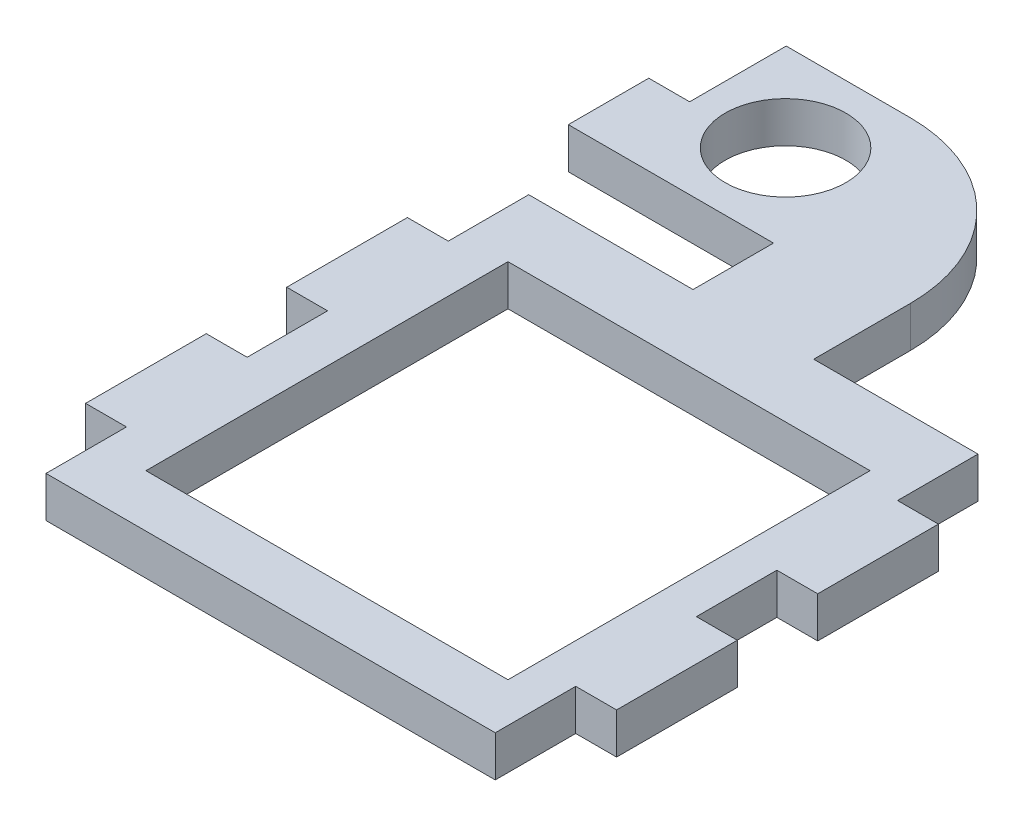
ISO-10303-21;
HEADER;
FILE_DESCRIPTION(('STEP AP214'),'2;1');
FILE_NAME('part.step','',(''),(''),'','','');
FILE_SCHEMA(('AUTOMOTIVE_DESIGN { 1 0 10303 214 1 1 1 1 }'));
ENDSEC;
DATA;
#1=APPLICATION_CONTEXT('core data for automotive mechanical design processes');
#2=APPLICATION_PROTOCOL_DEFINITION('international standard','automotive_design',2000,#1);
#3=PRODUCT_CONTEXT('',#1,'mechanical');
#4=PRODUCT('Part','Part','',(#3));
#5=PRODUCT_RELATED_PRODUCT_CATEGORY('part','',(#4));
#6=PRODUCT_DEFINITION_FORMATION('','',#4);
#7=PRODUCT_DEFINITION_CONTEXT('part definition',#1,'design');
#8=PRODUCT_DEFINITION('design','',#6,#7);
#9=PRODUCT_DEFINITION_SHAPE('','',#8);
#10=(LENGTH_UNIT() NAMED_UNIT(*) SI_UNIT(.MILLI.,.METRE.));
#11=(NAMED_UNIT(*) PLANE_ANGLE_UNIT() SI_UNIT($,.RADIAN.));
#12=(NAMED_UNIT(*) SI_UNIT($,.STERADIAN.) SOLID_ANGLE_UNIT());
#13=UNCERTAINTY_MEASURE_WITH_UNIT(LENGTH_MEASURE(1.E-05),#10,'distance_accuracy_value','');
#14=(GEOMETRIC_REPRESENTATION_CONTEXT(3) GLOBAL_UNCERTAINTY_ASSIGNED_CONTEXT((#13)) GLOBAL_UNIT_ASSIGNED_CONTEXT((#10,
#11,#12)) REPRESENTATION_CONTEXT('',''));
#15=CARTESIAN_POINT('',(0.,0.,0.));
#16=DIRECTION('',(0.,0.,1.));
#17=DIRECTION('',(1.,0.,0.));
#18=AXIS2_PLACEMENT_3D('',#15,#16,#17);
#19=CARTESIAN_POINT('',(27.92,5.08,-30.));
#20=DIRECTION('',(0.,0.,1.));
#21=DIRECTION('',(1.,0.,0.));
#22=AXIS2_PLACEMENT_3D('',#19,#20,#21);
#23=PLANE('',#22);
#24=DIRECTION('',(0.,1.,0.));
#25=VECTOR('',#24,1.);
#26=CARTESIAN_POINT('',(-7.5,-51.6163733712472,-30.));
#27=LINE('',#26,#25);
#28=CARTESIAN_POINT('',(-7.5,0.,-30.));
#29=VERTEX_POINT('',#28);
#30=CARTESIAN_POINT('',(-7.5,5.08,-30.));
#31=VERTEX_POINT('',#30);
#32=EDGE_CURVE('E286',#29,#31,#27,.T.);
#33=ORIENTED_EDGE('',*,*,#32,.F.);
#34=DIRECTION('',(-1.,0.,0.));
#35=VECTOR('',#34,1.);
#36=CARTESIAN_POINT('',(27.92,0.,-30.));
#37=LINE('',#36,#35);
#38=CARTESIAN_POINT('',(-27.92,0.,-30.));
#39=VERTEX_POINT('',#38);
#40=EDGE_CURVE('E385',#29,#39,#37,.T.);
#41=ORIENTED_EDGE('',*,*,#40,.T.);
#42=DIRECTION('',(0.,-1.,0.));
#43=VECTOR('',#42,1.);
#44=CARTESIAN_POINT('',(-27.92,5.08,-30.));
#45=LINE('',#44,#43);
#46=CARTESIAN_POINT('',(-27.92,5.08,-30.));
#47=VERTEX_POINT('',#46);
#48=EDGE_CURVE('E402',#47,#39,#45,.T.);
#49=ORIENTED_EDGE('',*,*,#48,.F.);
#50=DIRECTION('',(-1.,0.,0.));
#51=VECTOR('',#50,1.);
#52=CARTESIAN_POINT('',(27.92,5.08,-30.));
#53=LINE('',#52,#51);
#54=EDGE_CURVE('E457',#31,#47,#53,.T.);
#55=ORIENTED_EDGE('',*,*,#54,.F.);
#56=EDGE_LOOP('',(#33,#41,#49,#55));
#57=FACE_BOUND('',#56,.T.);
#58=ADVANCED_FACE('F33',(#57),#23,.F.);
#59=CARTESIAN_POINT('',(27.92,5.08,30.));
#60=DIRECTION('',(-1.,0.,0.));
#61=DIRECTION('',(0.,0.,1.));
#62=AXIS2_PLACEMENT_3D('',#59,#60,#61);
#63=PLANE('',#62);
#64=DIRECTION('',(0.,0.,-1.));
#65=VECTOR('',#64,1.);
#66=CARTESIAN_POINT('',(27.92,5.08,30.));
#67=LINE('',#66,#65);
#68=CARTESIAN_POINT('',(27.92,5.08,-20.));
#69=VERTEX_POINT('',#68);
#70=CARTESIAN_POINT('',(27.92,5.08,-30.));
#71=VERTEX_POINT('',#70);
#72=EDGE_CURVE('E393',#69,#71,#67,.T.);
#73=ORIENTED_EDGE('',*,*,#72,.F.);
#74=DIRECTION('',(0.,1.,0.));
#75=VECTOR('',#74,1.);
#76=CARTESIAN_POINT('',(27.92,-15.8368683773024,-20.));
#77=LINE('',#76,#75);
#78=CARTESIAN_POINT('',(27.92,0.,-20.));
#79=VERTEX_POINT('',#78);
#80=EDGE_CURVE('E686',#79,#69,#77,.T.);
#81=ORIENTED_EDGE('',*,*,#80,.F.);
#82=DIRECTION('',(0.,0.,-1.));
#83=VECTOR('',#82,1.);
#84=CARTESIAN_POINT('',(27.92,0.,30.));
#85=LINE('',#84,#83);
#86=CARTESIAN_POINT('',(27.92,0.,-30.));
#87=VERTEX_POINT('',#86);
#88=EDGE_CURVE('E432',#79,#87,#85,.T.);
#89=ORIENTED_EDGE('',*,*,#88,.T.);
#90=DIRECTION('',(0.,-1.,0.));
#91=VECTOR('',#90,1.);
#92=CARTESIAN_POINT('',(27.92,5.08,-30.));
#93=LINE('',#92,#91);
#94=EDGE_CURVE('E383',#71,#87,#93,.T.);
#95=ORIENTED_EDGE('',*,*,#94,.F.);
#96=EDGE_LOOP('',(#73,#81,#89,#95));
#97=FACE_BOUND('',#96,.T.);
#98=ADVANCED_FACE('F356',(#97),#63,.F.);
#99=CARTESIAN_POINT('',(-27.92,5.08,30.));
#100=DIRECTION('',(1.,0.,0.));
#101=DIRECTION('',(0.,0.,-1.));
#102=AXIS2_PLACEMENT_3D('',#99,#100,#101);
#103=PLANE('',#102);
#104=DIRECTION('',(0.,0.,1.));
#105=VECTOR('',#104,1.);
#106=CARTESIAN_POINT('',(-27.92,5.08,30.));
#107=LINE('',#106,#105);
#108=CARTESIAN_POINT('',(-27.92,5.08,-4.99999999999999));
#109=VERTEX_POINT('',#108);
#110=CARTESIAN_POINT('',(-27.92,5.08,5.00000000000001));
#111=VERTEX_POINT('',#110);
#112=EDGE_CURVE('E387',#109,#111,#107,.T.);
#113=ORIENTED_EDGE('',*,*,#112,.F.);
#114=DIRECTION('',(0.,1.,0.));
#115=VECTOR('',#114,1.);
#116=CARTESIAN_POINT('',(-27.92,-15.8368683773024,-4.99999999999999));
#117=LINE('',#116,#115);
#118=CARTESIAN_POINT('',(-27.92,0.,-4.99999999999999));
#119=VERTEX_POINT('',#118);
#120=EDGE_CURVE('E573',#119,#109,#117,.T.);
#121=ORIENTED_EDGE('',*,*,#120,.F.);
#122=DIRECTION('',(0.,0.,1.));
#123=VECTOR('',#122,1.);
#124=CARTESIAN_POINT('',(-27.92,0.,30.));
#125=LINE('',#124,#123);
#126=CARTESIAN_POINT('',(-27.92,0.,5.00000000000001));
#127=VERTEX_POINT('',#126);
#128=EDGE_CURVE('E417',#119,#127,#125,.T.);
#129=ORIENTED_EDGE('',*,*,#128,.T.);
#130=DIRECTION('',(0.,1.,0.));
#131=VECTOR('',#130,1.);
#132=CARTESIAN_POINT('',(-27.92,-15.8368683773024,5.00000000000001));
#133=LINE('',#132,#131);
#134=EDGE_CURVE('E528',#127,#111,#133,.T.);
#135=ORIENTED_EDGE('',*,*,#134,.T.);
#136=EDGE_LOOP('',(#113,#121,#129,#135));
#137=FACE_BOUND('',#136,.T.);
#138=ADVANCED_FACE('F353',(#137),#103,.F.);
#139=CARTESIAN_POINT('',(27.92,0.,5.));
#140=VERTEX_POINT('',#139);
#141=CARTESIAN_POINT('',(27.92,0.,-5.));
#142=VERTEX_POINT('',#141);
#143=EDGE_CURVE('E533',#140,#142,#85,.T.);
#144=ORIENTED_EDGE('',*,*,#143,.T.);
#145=DIRECTION('',(0.,1.,0.));
#146=VECTOR('',#145,1.);
#147=CARTESIAN_POINT('',(27.92,-15.8368683773024,-5.));
#148=LINE('',#147,#146);
#149=CARTESIAN_POINT('',(27.92,5.08,-5.));
#150=VERTEX_POINT('',#149);
#151=EDGE_CURVE('E561',#142,#150,#148,.T.);
#152=ORIENTED_EDGE('',*,*,#151,.T.);
#153=CARTESIAN_POINT('',(27.92,5.08,5.));
#154=VERTEX_POINT('',#153);
#155=EDGE_CURVE('E449',#154,#150,#67,.T.);
#156=ORIENTED_EDGE('',*,*,#155,.F.);
#157=DIRECTION('',(0.,1.,0.));
#158=VECTOR('',#157,1.);
#159=CARTESIAN_POINT('',(27.92,-15.8368683773024,5.));
#160=LINE('',#159,#158);
#161=EDGE_CURVE('E461',#140,#154,#160,.T.);
#162=ORIENTED_EDGE('',*,*,#161,.F.);
#163=EDGE_LOOP('',(#144,#152,#156,#162));
#164=FACE_BOUND('',#163,.T.);
#165=ADVANCED_FACE('F351',(#164),#63,.F.);
#166=DIRECTION('',(0.,1.,0.));
#167=VECTOR('',#166,1.);
#168=CARTESIAN_POINT('',(-27.92,-15.8368683773024,20.));
#169=LINE('',#168,#167);
#170=CARTESIAN_POINT('',(-27.92,0.,20.));
#171=VERTEX_POINT('',#170);
#172=CARTESIAN_POINT('',(-27.92,5.08,20.));
#173=VERTEX_POINT('',#172);
#174=EDGE_CURVE('E621',#171,#173,#169,.T.);
#175=ORIENTED_EDGE('',*,*,#174,.F.);
#176=CARTESIAN_POINT('',(-27.92,0.,30.));
#177=VERTEX_POINT('',#176);
#178=EDGE_CURVE('E418',#171,#177,#125,.T.);
#179=ORIENTED_EDGE('',*,*,#178,.T.);
#180=DIRECTION('',(0.,-1.,0.));
#181=VECTOR('',#180,1.);
#182=CARTESIAN_POINT('',(-27.92,5.08,30.));
#183=LINE('',#182,#181);
#184=CARTESIAN_POINT('',(-27.92,5.08,30.));
#185=VERTEX_POINT('',#184);
#186=EDGE_CURVE('E301',#185,#177,#183,.T.);
#187=ORIENTED_EDGE('',*,*,#186,.F.);
#188=EDGE_CURVE('E384',#173,#185,#107,.T.);
#189=ORIENTED_EDGE('',*,*,#188,.F.);
#190=EDGE_LOOP('',(#175,#179,#187,#189));
#191=FACE_BOUND('',#190,.T.);
#192=ADVANCED_FACE('F342',(#191),#103,.F.);
#193=CARTESIAN_POINT('',(0.,5.08,0.));
#194=DIRECTION('',(0.,1.,0.));
#195=DIRECTION('',(0.,0.,1.));
#196=AXIS2_PLACEMENT_3D('',#193,#194,#195);
#197=PLANE('',#196);
#198=DIRECTION('',(0.,0.,-1.));
#199=VECTOR('',#198,1.);
#200=CARTESIAN_POINT('',(-27.92,5.08,-62.));
#201=LINE('',#200,#199);
#202=CARTESIAN_POINT('',(-27.92,5.08,-50.));
#203=VERTEX_POINT('',#202);
#204=CARTESIAN_POINT('',(-27.92,5.08,-62.));
#205=VERTEX_POINT('',#204);
#206=EDGE_CURVE('E262',#203,#205,#201,.T.);
#207=ORIENTED_EDGE('',*,*,#206,.F.);
#208=DIRECTION('',(1.,0.,0.));
#209=VECTOR('',#208,1.);
#210=CARTESIAN_POINT('',(-33.,5.08,-50.));
#211=LINE('',#210,#209);
#212=CARTESIAN_POINT('',(-33.,5.08,-50.));
#213=VERTEX_POINT('',#212);
#214=EDGE_CURVE('E249',#213,#203,#211,.T.);
#215=ORIENTED_EDGE('',*,*,#214,.F.);
#216=DIRECTION('',(0.,0.,1.));
#217=VECTOR('',#216,1.);
#218=CARTESIAN_POINT('',(-33.,5.08,-40.));
#219=LINE('',#218,#217);
#220=CARTESIAN_POINT('',(-33.,5.08,-40.));
#221=VERTEX_POINT('',#220);
#222=EDGE_CURVE('E259',#213,#221,#219,.T.);
#223=ORIENTED_EDGE('',*,*,#222,.T.);
#224=DIRECTION('',(1.,0.,0.));
#225=VECTOR('',#224,1.);
#226=CARTESIAN_POINT('',(-7.5,5.08,-40.));
#227=LINE('',#226,#225);
#228=CARTESIAN_POINT('',(-7.5,5.08,-40.));
#229=VERTEX_POINT('',#228);
#230=EDGE_CURVE('E268',#221,#229,#227,.T.);
#231=ORIENTED_EDGE('',*,*,#230,.T.);
#232=DIRECTION('',(0.,0.,1.));
#233=VECTOR('',#232,1.);
#234=CARTESIAN_POINT('',(-7.5,5.08,-30.));
#235=LINE('',#234,#233);
#236=EDGE_CURVE('E271',#229,#31,#235,.T.);
#237=ORIENTED_EDGE('',*,*,#236,.T.);
#238=ORIENTED_EDGE('',*,*,#54,.T.);
#239=CARTESIAN_POINT('',(-27.92,5.08,-20.));
#240=VERTEX_POINT('',#239);
#241=EDGE_CURVE('E431',#47,#240,#107,.T.);
#242=ORIENTED_EDGE('',*,*,#241,.T.);
#243=DIRECTION('',(-1.,0.,0.));
#244=VECTOR('',#243,1.);
#245=CARTESIAN_POINT('',(-27.92,5.08,-20.));
#246=LINE('',#245,#244);
#247=CARTESIAN_POINT('',(-33.,5.08,-20.));
#248=VERTEX_POINT('',#247);
#249=EDGE_CURVE('E558',#240,#248,#246,.T.);
#250=ORIENTED_EDGE('',*,*,#249,.T.);
#251=DIRECTION('',(0.,0.,1.));
#252=VECTOR('',#251,1.);
#253=CARTESIAN_POINT('',(-33.,5.08,-4.99999999999999));
#254=LINE('',#253,#252);
#255=CARTESIAN_POINT('',(-33.,5.08,-4.99999999999999));
#256=VERTEX_POINT('',#255);
#257=EDGE_CURVE('E576',#248,#256,#254,.T.);
#258=ORIENTED_EDGE('',*,*,#257,.T.);
#259=DIRECTION('',(1.,0.,0.));
#260=VECTOR('',#259,1.);
#261=CARTESIAN_POINT('',(-27.92,5.08,-4.99999999999999));
#262=LINE('',#261,#260);
#263=EDGE_CURVE('E579',#256,#109,#262,.T.);
#264=ORIENTED_EDGE('',*,*,#263,.T.);
#265=ORIENTED_EDGE('',*,*,#112,.T.);
#266=DIRECTION('',(-1.,0.,0.));
#267=VECTOR('',#266,1.);
#268=CARTESIAN_POINT('',(-27.92,5.08,5.00000000000001));
#269=LINE('',#268,#267);
#270=CARTESIAN_POINT('',(-33.,5.08,5.00000000000001));
#271=VERTEX_POINT('',#270);
#272=EDGE_CURVE('E513',#111,#271,#269,.T.);
#273=ORIENTED_EDGE('',*,*,#272,.T.);
#274=DIRECTION('',(0.,0.,1.));
#275=VECTOR('',#274,1.);
#276=CARTESIAN_POINT('',(-33.,5.08,20.));
#277=LINE('',#276,#275);
#278=CARTESIAN_POINT('',(-33.,5.08,20.));
#279=VERTEX_POINT('',#278);
#280=EDGE_CURVE('E521',#271,#279,#277,.T.);
#281=ORIENTED_EDGE('',*,*,#280,.T.);
#282=DIRECTION('',(1.,0.,0.));
#283=VECTOR('',#282,1.);
#284=CARTESIAN_POINT('',(-27.92,5.08,20.));
#285=LINE('',#284,#283);
#286=EDGE_CURVE('E525',#279,#173,#285,.T.);
#287=ORIENTED_EDGE('',*,*,#286,.T.);
#288=ORIENTED_EDGE('',*,*,#188,.T.);
#289=DIRECTION('',(1.,0.,0.));
#290=VECTOR('',#289,1.);
#291=CARTESIAN_POINT('',(27.92,5.08,30.));
#292=LINE('',#291,#290);
#293=CARTESIAN_POINT('',(27.92,5.08,30.));
#294=VERTEX_POINT('',#293);
#295=EDGE_CURVE('E438',#185,#294,#292,.T.);
#296=ORIENTED_EDGE('',*,*,#295,.T.);
#297=CARTESIAN_POINT('',(27.92,5.08,20.));
#298=VERTEX_POINT('',#297);
#299=EDGE_CURVE('E452',#294,#298,#67,.T.);
#300=ORIENTED_EDGE('',*,*,#299,.T.);
#301=DIRECTION('',(1.,0.,0.));
#302=VECTOR('',#301,1.);
#303=CARTESIAN_POINT('',(27.92,5.08,20.));
#304=LINE('',#303,#302);
#305=CARTESIAN_POINT('',(33.,5.08,20.));
#306=VERTEX_POINT('',#305);
#307=EDGE_CURVE('E489',#298,#306,#304,.T.);
#308=ORIENTED_EDGE('',*,*,#307,.T.);
#309=DIRECTION('',(0.,0.,-1.));
#310=VECTOR('',#309,1.);
#311=CARTESIAN_POINT('',(33.,5.08,20.));
#312=LINE('',#311,#310);
#313=CARTESIAN_POINT('',(33.,5.08,5.));
#314=VERTEX_POINT('',#313);
#315=EDGE_CURVE('E475',#306,#314,#312,.T.);
#316=ORIENTED_EDGE('',*,*,#315,.T.);
#317=DIRECTION('',(-1.,0.,0.));
#318=VECTOR('',#317,1.);
#319=CARTESIAN_POINT('',(27.92,5.08,5.));
#320=LINE('',#319,#318);
#321=EDGE_CURVE('E470',#314,#154,#320,.T.);
#322=ORIENTED_EDGE('',*,*,#321,.T.);
#323=ORIENTED_EDGE('',*,*,#155,.T.);
#324=DIRECTION('',(1.,0.,0.));
#325=VECTOR('',#324,1.);
#326=CARTESIAN_POINT('',(27.92,5.08,-5.));
#327=LINE('',#326,#325);
#328=CARTESIAN_POINT('',(33.,5.08,-5.));
#329=VERTEX_POINT('',#328);
#330=EDGE_CURVE('E563',#150,#329,#327,.T.);
#331=ORIENTED_EDGE('',*,*,#330,.T.);
#332=DIRECTION('',(0.,0.,-1.));
#333=VECTOR('',#332,1.);
#334=CARTESIAN_POINT('',(33.,5.08,-5.));
#335=LINE('',#334,#333);
#336=CARTESIAN_POINT('',(33.,5.08,-20.));
#337=VERTEX_POINT('',#336);
#338=EDGE_CURVE('E569',#329,#337,#335,.T.);
#339=ORIENTED_EDGE('',*,*,#338,.T.);
#340=DIRECTION('',(-1.,0.,0.));
#341=VECTOR('',#340,1.);
#342=CARTESIAN_POINT('',(27.92,5.08,-20.));
#343=LINE('',#342,#341);
#344=EDGE_CURVE('E565',#337,#69,#343,.T.);
#345=ORIENTED_EDGE('',*,*,#344,.T.);
#346=ORIENTED_EDGE('',*,*,#72,.T.);
#347=CARTESIAN_POINT('',(7.5,5.08,-30.));
#348=VERTEX_POINT('',#347);
#349=EDGE_CURVE('E406',#71,#348,#53,.T.);
#350=ORIENTED_EDGE('',*,*,#349,.T.);
#351=DIRECTION('',(0.,0.,-1.));
#352=VECTOR('',#351,1.);
#353=CARTESIAN_POINT('',(7.5,5.08,-30.));
#354=LINE('',#353,#352);
#355=CARTESIAN_POINT('',(7.5,5.08,-42.));
#356=VERTEX_POINT('',#355);
#357=EDGE_CURVE('E289',#348,#356,#354,.T.);
#358=ORIENTED_EDGE('',*,*,#357,.T.);
#359=CARTESIAN_POINT('',(-12.5,5.08,-42.));
#360=DIRECTION('',(0.,1.,0.));
#361=DIRECTION('',(0.,0.,1.));
#362=AXIS2_PLACEMENT_3D('',#359,#360,#361);
#363=CIRCLE('',#362,20.);
#364=CARTESIAN_POINT('',(-12.5,5.08,-62.));
#365=VERTEX_POINT('',#364);
#366=EDGE_CURVE('E300',#356,#365,#363,.T.);
#367=ORIENTED_EDGE('',*,*,#366,.T.);
#368=DIRECTION('',(-1.,0.,0.));
#369=VECTOR('',#368,1.);
#370=CARTESIAN_POINT('',(7.5,5.08,-62.));
#371=LINE('',#370,#369);
#372=EDGE_CURVE('E269',#365,#205,#371,.T.);
#373=ORIENTED_EDGE('',*,*,#372,.T.);
#374=EDGE_LOOP('',(#207,#215,#223,#231,#237,#238,#242,#250,#258,#264,#265,#273,#281,#287,#288,
#296,#300,#308,#316,#322,#323,#331,#339,#345,#346,#350,#358,#367,#373));
#375=FACE_BOUND('',#374,.T.);
#376=DIRECTION('',(-1.,0.,0.));
#377=VECTOR('',#376,1.);
#378=CARTESIAN_POINT('',(-22.,5.08,-21.5));
#379=LINE('',#378,#377);
#380=CARTESIAN_POINT('',(23.,5.08,-21.5));
#381=VERTEX_POINT('',#380);
#382=CARTESIAN_POINT('',(-22.,5.08,-21.5));
#383=VERTEX_POINT('',#382);
#384=EDGE_CURVE('E664',#381,#383,#379,.T.);
#385=ORIENTED_EDGE('',*,*,#384,.F.);
#386=DIRECTION('',(0.,0.,-1.));
#387=VECTOR('',#386,1.);
#388=CARTESIAN_POINT('',(23.,5.08,23.5));
#389=LINE('',#388,#387);
#390=CARTESIAN_POINT('',(23.,5.08,23.5));
#391=VERTEX_POINT('',#390);
#392=EDGE_CURVE('E648',#391,#381,#389,.T.);
#393=ORIENTED_EDGE('',*,*,#392,.F.);
#394=DIRECTION('',(1.,0.,0.));
#395=VECTOR('',#394,1.);
#396=CARTESIAN_POINT('',(-22.,5.08,23.5));
#397=LINE('',#396,#395);
#398=CARTESIAN_POINT('',(-22.,5.08,23.5));
#399=VERTEX_POINT('',#398);
#400=EDGE_CURVE('E641',#399,#391,#397,.T.);
#401=ORIENTED_EDGE('',*,*,#400,.F.);
#402=DIRECTION('',(0.,0.,1.));
#403=VECTOR('',#402,1.);
#404=CARTESIAN_POINT('',(-22.,5.08,23.5));
#405=LINE('',#404,#403);
#406=EDGE_CURVE('E665',#383,#399,#405,.T.);
#407=ORIENTED_EDGE('',*,*,#406,.F.);
#408=EDGE_LOOP('',(#385,#393,#401,#407));
#409=FACE_BOUND('',#408,.T.);
#410=CARTESIAN_POINT('',(-17.,5.08,-51.));
#411=DIRECTION('',(0.,1.,0.));
#412=DIRECTION('',(0.,0.,1.));
#413=AXIS2_PLACEMENT_3D('',#410,#411,#412);
#414=CIRCLE('',#413,7.5);
#415=CARTESIAN_POINT('',(-17.,5.08,-43.5));
#416=VERTEX_POINT('',#415);
#417=EDGE_CURVE('E273',#416,#416,#414,.T.);
#418=ORIENTED_EDGE('',*,*,#417,.F.);
#419=EDGE_LOOP('',(#418));
#420=FACE_BOUND('',#419,.T.);
#421=ADVANCED_FACE('F256',(#375,#409,#420),#197,.T.);
#422=CARTESIAN_POINT('',(0.,0.,0.));
#423=DIRECTION('',(0.,1.,0.));
#424=DIRECTION('',(0.,0.,1.));
#425=AXIS2_PLACEMENT_3D('',#422,#423,#424);
#426=PLANE('',#425);
#427=DIRECTION('',(1.,0.,0.));
#428=VECTOR('',#427,1.);
#429=CARTESIAN_POINT('',(0.,0.,-50.));
#430=LINE('',#429,#428);
#431=CARTESIAN_POINT('',(-33.,0.,-50.));
#432=VERTEX_POINT('',#431);
#433=CARTESIAN_POINT('',(-27.92,0.,-50.));
#434=VERTEX_POINT('',#433);
#435=EDGE_CURVE('E47',#432,#434,#430,.T.);
#436=ORIENTED_EDGE('',*,*,#435,.T.);
#437=DIRECTION('',(0.,0.,-1.));
#438=VECTOR('',#437,1.);
#439=CARTESIAN_POINT('',(-27.92,0.,0.));
#440=LINE('',#439,#438);
#441=CARTESIAN_POINT('',(-27.92,0.,-62.));
#442=VERTEX_POINT('',#441);
#443=EDGE_CURVE('E326',#434,#442,#440,.T.);
#444=ORIENTED_EDGE('',*,*,#443,.T.);
#445=DIRECTION('',(1.,0.,0.));
#446=VECTOR('',#445,1.);
#447=CARTESIAN_POINT('',(7.5,0.,-62.));
#448=LINE('',#447,#446);
#449=CARTESIAN_POINT('',(-12.5,0.,-62.));
#450=VERTEX_POINT('',#449);
#451=EDGE_CURVE('E55',#442,#450,#448,.T.);
#452=ORIENTED_EDGE('',*,*,#451,.T.);
#453=CARTESIAN_POINT('',(-12.5,0.,-42.));
#454=DIRECTION('',(0.,1.,0.));
#455=DIRECTION('',(0.,0.,1.));
#456=AXIS2_PLACEMENT_3D('',#453,#454,#455);
#457=CIRCLE('',#456,20.);
#458=CARTESIAN_POINT('',(7.5,0.,-42.));
#459=VERTEX_POINT('',#458);
#460=EDGE_CURVE('E41',#450,#459,#457,.F.);
#461=ORIENTED_EDGE('',*,*,#460,.T.);
#462=DIRECTION('',(0.,0.,1.));
#463=VECTOR('',#462,1.);
#464=CARTESIAN_POINT('',(7.5,0.,-30.));
#465=LINE('',#464,#463);
#466=CARTESIAN_POINT('',(7.5,0.,-30.));
#467=VERTEX_POINT('',#466);
#468=EDGE_CURVE('E294',#459,#467,#465,.T.);
#469=ORIENTED_EDGE('',*,*,#468,.T.);
#470=EDGE_CURVE('E380',#87,#467,#37,.T.);
#471=ORIENTED_EDGE('',*,*,#470,.F.);
#472=ORIENTED_EDGE('',*,*,#88,.F.);
#473=DIRECTION('',(1.,0.,0.));
#474=VECTOR('',#473,1.);
#475=CARTESIAN_POINT('',(27.92,0.,-20.));
#476=LINE('',#475,#474);
#477=CARTESIAN_POINT('',(33.,0.,-20.));
#478=VERTEX_POINT('',#477);
#479=EDGE_CURVE('E559',#79,#478,#476,.T.);
#480=ORIENTED_EDGE('',*,*,#479,.T.);
#481=DIRECTION('',(0.,0.,1.));
#482=VECTOR('',#481,1.);
#483=CARTESIAN_POINT('',(33.,0.,-5.));
#484=LINE('',#483,#482);
#485=CARTESIAN_POINT('',(33.,0.,-5.));
#486=VERTEX_POINT('',#485);
#487=EDGE_CURVE('E555',#478,#486,#484,.T.);
#488=ORIENTED_EDGE('',*,*,#487,.T.);
#489=DIRECTION('',(-1.,0.,0.));
#490=VECTOR('',#489,1.);
#491=CARTESIAN_POINT('',(27.92,0.,-5.));
#492=LINE('',#491,#490);
#493=EDGE_CURVE('E552',#486,#142,#492,.T.);
#494=ORIENTED_EDGE('',*,*,#493,.T.);
#495=ORIENTED_EDGE('',*,*,#143,.F.);
#496=DIRECTION('',(1.,0.,0.));
#497=VECTOR('',#496,1.);
#498=CARTESIAN_POINT('',(27.92,0.,5.));
#499=LINE('',#498,#497);
#500=CARTESIAN_POINT('',(33.,0.,5.));
#501=VERTEX_POINT('',#500);
#502=EDGE_CURVE('E505',#140,#501,#499,.T.);
#503=ORIENTED_EDGE('',*,*,#502,.T.);
#504=DIRECTION('',(0.,0.,1.));
#505=VECTOR('',#504,1.);
#506=CARTESIAN_POINT('',(33.,0.,20.));
#507=LINE('',#506,#505);
#508=CARTESIAN_POINT('',(33.,0.,20.));
#509=VERTEX_POINT('',#508);
#510=EDGE_CURVE('E468',#501,#509,#507,.T.);
#511=ORIENTED_EDGE('',*,*,#510,.T.);
#512=DIRECTION('',(-1.,0.,0.));
#513=VECTOR('',#512,1.);
#514=CARTESIAN_POINT('',(27.92,0.,20.));
#515=LINE('',#514,#513);
#516=CARTESIAN_POINT('',(27.92,0.,20.));
#517=VERTEX_POINT('',#516);
#518=EDGE_CURVE('E509',#509,#517,#515,.T.);
#519=ORIENTED_EDGE('',*,*,#518,.T.);
#520=CARTESIAN_POINT('',(27.92,0.,30.));
#521=VERTEX_POINT('',#520);
#522=EDGE_CURVE('E389',#521,#517,#85,.T.);
#523=ORIENTED_EDGE('',*,*,#522,.F.);
#524=DIRECTION('',(1.,0.,0.));
#525=VECTOR('',#524,1.);
#526=CARTESIAN_POINT('',(27.92,0.,30.));
#527=LINE('',#526,#525);
#528=EDGE_CURVE('E416',#177,#521,#527,.T.);
#529=ORIENTED_EDGE('',*,*,#528,.F.);
#530=ORIENTED_EDGE('',*,*,#178,.F.);
#531=DIRECTION('',(-1.,0.,0.));
#532=VECTOR('',#531,1.);
#533=CARTESIAN_POINT('',(-27.92,0.,20.));
#534=LINE('',#533,#532);
#535=CARTESIAN_POINT('',(-33.,0.,20.));
#536=VERTEX_POINT('',#535);
#537=EDGE_CURVE('E627',#171,#536,#534,.T.);
#538=ORIENTED_EDGE('',*,*,#537,.T.);
#539=DIRECTION('',(0.,0.,-1.));
#540=VECTOR('',#539,1.);
#541=CARTESIAN_POINT('',(-33.,0.,20.));
#542=LINE('',#541,#540);
#543=CARTESIAN_POINT('',(-33.,0.,5.00000000000001));
#544=VERTEX_POINT('',#543);
#545=EDGE_CURVE('E483',#536,#544,#542,.T.);
#546=ORIENTED_EDGE('',*,*,#545,.T.);
#547=DIRECTION('',(1.,0.,0.));
#548=VECTOR('',#547,1.);
#549=CARTESIAN_POINT('',(-27.92,0.,5.00000000000001));
#550=LINE('',#549,#548);
#551=EDGE_CURVE('E608',#544,#127,#550,.T.);
#552=ORIENTED_EDGE('',*,*,#551,.T.);
#553=ORIENTED_EDGE('',*,*,#128,.F.);
#554=DIRECTION('',(-1.,0.,0.));
#555=VECTOR('',#554,1.);
#556=CARTESIAN_POINT('',(-27.92,0.,-4.99999999999999));
#557=LINE('',#556,#555);
#558=CARTESIAN_POINT('',(-33.,0.,-4.99999999999999));
#559=VERTEX_POINT('',#558);
#560=EDGE_CURVE('E495',#119,#559,#557,.T.);
#561=ORIENTED_EDGE('',*,*,#560,.T.);
#562=DIRECTION('',(0.,0.,-1.));
#563=VECTOR('',#562,1.);
#564=CARTESIAN_POINT('',(-33.,0.,-4.99999999999999));
#565=LINE('',#564,#563);
#566=CARTESIAN_POINT('',(-33.,0.,-20.));
#567=VERTEX_POINT('',#566);
#568=EDGE_CURVE('E500',#559,#567,#565,.T.);
#569=ORIENTED_EDGE('',*,*,#568,.T.);
#570=DIRECTION('',(1.,0.,0.));
#571=VECTOR('',#570,1.);
#572=CARTESIAN_POINT('',(-27.92,0.,-20.));
#573=LINE('',#572,#571);
#574=CARTESIAN_POINT('',(-27.92,0.,-20.));
#575=VERTEX_POINT('',#574);
#576=EDGE_CURVE('E491',#567,#575,#573,.T.);
#577=ORIENTED_EDGE('',*,*,#576,.T.);
#578=EDGE_CURVE('E413',#39,#575,#125,.T.);
#579=ORIENTED_EDGE('',*,*,#578,.F.);
#580=ORIENTED_EDGE('',*,*,#40,.F.);
#581=DIRECTION('',(0.,0.,-1.));
#582=VECTOR('',#581,1.);
#583=CARTESIAN_POINT('',(-7.5,0.,-30.));
#584=LINE('',#583,#582);
#585=CARTESIAN_POINT('',(-7.5,0.,-40.));
#586=VERTEX_POINT('',#585);
#587=EDGE_CURVE('E296',#29,#586,#584,.T.);
#588=ORIENTED_EDGE('',*,*,#587,.T.);
#589=DIRECTION('',(-1.,0.,0.));
#590=VECTOR('',#589,1.);
#591=CARTESIAN_POINT('',(-7.5,0.,-40.));
#592=LINE('',#591,#590);
#593=CARTESIAN_POINT('',(-33.,0.,-40.));
#594=VERTEX_POINT('',#593);
#595=EDGE_CURVE('E335',#586,#594,#592,.T.);
#596=ORIENTED_EDGE('',*,*,#595,.T.);
#597=DIRECTION('',(0.,0.,-1.));
#598=VECTOR('',#597,1.);
#599=CARTESIAN_POINT('',(-33.,0.,-40.));
#600=LINE('',#599,#598);
#601=EDGE_CURVE('E285',#594,#432,#600,.T.);
#602=ORIENTED_EDGE('',*,*,#601,.T.);
#603=EDGE_LOOP('',(#436,#444,#452,#461,#469,#471,#472,#480,#488,#494,#495,#503,#511,#519,#523,
#529,#530,#538,#546,#552,#553,#561,#569,#577,#579,#580,#588,#596,#602));
#604=FACE_BOUND('',#603,.T.);
#605=DIRECTION('',(0.,0.,-1.));
#606=VECTOR('',#605,1.);
#607=CARTESIAN_POINT('',(23.,0.,23.5));
#608=LINE('',#607,#606);
#609=CARTESIAN_POINT('',(23.,0.,23.5));
#610=VERTEX_POINT('',#609);
#611=CARTESIAN_POINT('',(23.,0.,-21.5));
#612=VERTEX_POINT('',#611);
#613=EDGE_CURVE('E631',#610,#612,#608,.T.);
#614=ORIENTED_EDGE('',*,*,#613,.T.);
#615=DIRECTION('',(-1.,0.,0.));
#616=VECTOR('',#615,1.);
#617=CARTESIAN_POINT('',(-22.,0.,-21.5));
#618=LINE('',#617,#616);
#619=CARTESIAN_POINT('',(-22.,0.,-21.5));
#620=VERTEX_POINT('',#619);
#621=EDGE_CURVE('E634',#612,#620,#618,.T.);
#622=ORIENTED_EDGE('',*,*,#621,.T.);
#623=DIRECTION('',(0.,0.,1.));
#624=VECTOR('',#623,1.);
#625=CARTESIAN_POINT('',(-22.,0.,23.5));
#626=LINE('',#625,#624);
#627=CARTESIAN_POINT('',(-22.,0.,23.5));
#628=VERTEX_POINT('',#627);
#629=EDGE_CURVE('E638',#620,#628,#626,.T.);
#630=ORIENTED_EDGE('',*,*,#629,.T.);
#631=DIRECTION('',(1.,0.,0.));
#632=VECTOR('',#631,1.);
#633=CARTESIAN_POINT('',(-22.,0.,23.5));
#634=LINE('',#633,#632);
#635=EDGE_CURVE('E646',#628,#610,#634,.T.);
#636=ORIENTED_EDGE('',*,*,#635,.T.);
#637=EDGE_LOOP('',(#614,#622,#630,#636));
#638=FACE_BOUND('',#637,.T.);
#639=CARTESIAN_POINT('',(-17.,0.,-51.));
#640=DIRECTION('',(0.,1.,0.));
#641=DIRECTION('',(0.,0.,1.));
#642=AXIS2_PLACEMENT_3D('',#639,#640,#641);
#643=CIRCLE('',#642,7.5);
#644=CARTESIAN_POINT('',(-17.,0.,-43.5));
#645=VERTEX_POINT('',#644);
#646=EDGE_CURVE('E333',#645,#645,#643,.F.);
#647=ORIENTED_EDGE('',*,*,#646,.F.);
#648=EDGE_LOOP('',(#647));
#649=FACE_BOUND('',#648,.T.);
#650=ADVANCED_FACE('F306',(#604,#638,#649),#426,.F.);
#651=ORIENTED_EDGE('',*,*,#578,.T.);
#652=DIRECTION('',(0.,1.,0.));
#653=VECTOR('',#652,1.);
#654=CARTESIAN_POINT('',(-27.92,-15.8368683773024,-20.));
#655=LINE('',#654,#653);
#656=EDGE_CURVE('E503',#575,#240,#655,.T.);
#657=ORIENTED_EDGE('',*,*,#656,.T.);
#658=ORIENTED_EDGE('',*,*,#241,.F.);
#659=ORIENTED_EDGE('',*,*,#48,.T.);
#660=EDGE_LOOP('',(#651,#657,#658,#659));
#661=FACE_BOUND('',#660,.T.);
#662=ADVANCED_FACE('F348',(#661),#103,.F.);
#663=CARTESIAN_POINT('',(27.92,5.08,30.));
#664=DIRECTION('',(0.,0.,-1.));
#665=DIRECTION('',(-1.,0.,0.));
#666=AXIS2_PLACEMENT_3D('',#663,#664,#665);
#667=PLANE('',#666);
#668=ORIENTED_EDGE('',*,*,#528,.T.);
#669=DIRECTION('',(0.,-1.,0.));
#670=VECTOR('',#669,1.);
#671=CARTESIAN_POINT('',(27.92,5.08,30.));
#672=LINE('',#671,#670);
#673=EDGE_CURVE('E408',#294,#521,#672,.T.);
#674=ORIENTED_EDGE('',*,*,#673,.F.);
#675=ORIENTED_EDGE('',*,*,#295,.F.);
#676=ORIENTED_EDGE('',*,*,#186,.T.);
#677=EDGE_LOOP('',(#668,#674,#675,#676));
#678=FACE_BOUND('',#677,.T.);
#679=ADVANCED_FACE('F377',(#678),#667,.F.);
#680=ORIENTED_EDGE('',*,*,#522,.T.);
#681=DIRECTION('',(0.,1.,0.));
#682=VECTOR('',#681,1.);
#683=CARTESIAN_POINT('',(27.92,-15.8368683773024,20.));
#684=LINE('',#683,#682);
#685=EDGE_CURVE('E480',#517,#298,#684,.T.);
#686=ORIENTED_EDGE('',*,*,#685,.T.);
#687=ORIENTED_EDGE('',*,*,#299,.F.);
#688=ORIENTED_EDGE('',*,*,#673,.T.);
#689=EDGE_LOOP('',(#680,#686,#687,#688));
#690=FACE_BOUND('',#689,.T.);
#691=ADVANCED_FACE('F367',(#690),#63,.F.);
#692=ORIENTED_EDGE('',*,*,#470,.T.);
#693=DIRECTION('',(0.,1.,0.));
#694=VECTOR('',#693,1.);
#695=CARTESIAN_POINT('',(7.5,-51.6163733712472,-30.));
#696=LINE('',#695,#694);
#697=EDGE_CURVE('E282',#467,#348,#696,.T.);
#698=ORIENTED_EDGE('',*,*,#697,.T.);
#699=ORIENTED_EDGE('',*,*,#349,.F.);
#700=ORIENTED_EDGE('',*,*,#94,.T.);
#701=EDGE_LOOP('',(#692,#698,#699,#700));
#702=FACE_BOUND('',#701,.T.);
#703=ADVANCED_FACE('F359',(#702),#23,.F.);
#704=CARTESIAN_POINT('',(23.,5.08,23.5));
#705=DIRECTION('',(-1.,0.,0.));
#706=DIRECTION('',(0.,0.,1.));
#707=AXIS2_PLACEMENT_3D('',#704,#705,#706);
#708=PLANE('',#707);
#709=ORIENTED_EDGE('',*,*,#613,.F.);
#710=DIRECTION('',(0.,-1.,0.));
#711=VECTOR('',#710,1.);
#712=CARTESIAN_POINT('',(23.,5.08,23.5));
#713=LINE('',#712,#711);
#714=EDGE_CURVE('E649',#391,#610,#713,.T.);
#715=ORIENTED_EDGE('',*,*,#714,.F.);
#716=ORIENTED_EDGE('',*,*,#392,.T.);
#717=DIRECTION('',(0.,-1.,0.));
#718=VECTOR('',#717,1.);
#719=CARTESIAN_POINT('',(23.,5.08,-21.5));
#720=LINE('',#719,#718);
#721=EDGE_CURVE('E436',#381,#612,#720,.T.);
#722=ORIENTED_EDGE('',*,*,#721,.T.);
#723=EDGE_LOOP('',(#709,#715,#716,#722));
#724=FACE_BOUND('',#723,.T.);
#725=ADVANCED_FACE('F368',(#724),#708,.T.);
#726=CARTESIAN_POINT('',(-22.,5.08,-21.5));
#727=DIRECTION('',(0.,0.,1.));
#728=DIRECTION('',(1.,0.,0.));
#729=AXIS2_PLACEMENT_3D('',#726,#727,#728);
#730=PLANE('',#729);
#731=ORIENTED_EDGE('',*,*,#621,.F.);
#732=ORIENTED_EDGE('',*,*,#721,.F.);
#733=ORIENTED_EDGE('',*,*,#384,.T.);
#734=DIRECTION('',(0.,-1.,0.));
#735=VECTOR('',#734,1.);
#736=CARTESIAN_POINT('',(-22.,5.08,-21.5));
#737=LINE('',#736,#735);
#738=EDGE_CURVE('E653',#383,#620,#737,.T.);
#739=ORIENTED_EDGE('',*,*,#738,.T.);
#740=EDGE_LOOP('',(#731,#732,#733,#739));
#741=FACE_BOUND('',#740,.T.);
#742=ADVANCED_FACE('F374',(#741),#730,.T.);
#743=CARTESIAN_POINT('',(-22.,5.08,23.5));
#744=DIRECTION('',(1.,0.,0.));
#745=DIRECTION('',(0.,0.,-1.));
#746=AXIS2_PLACEMENT_3D('',#743,#744,#745);
#747=PLANE('',#746);
#748=ORIENTED_EDGE('',*,*,#629,.F.);
#749=ORIENTED_EDGE('',*,*,#738,.F.);
#750=ORIENTED_EDGE('',*,*,#406,.T.);
#751=DIRECTION('',(0.,-1.,0.));
#752=VECTOR('',#751,1.);
#753=CARTESIAN_POINT('',(-22.,5.08,23.5));
#754=LINE('',#753,#752);
#755=EDGE_CURVE('E652',#399,#628,#754,.T.);
#756=ORIENTED_EDGE('',*,*,#755,.T.);
#757=EDGE_LOOP('',(#748,#749,#750,#756));
#758=FACE_BOUND('',#757,.T.);
#759=ADVANCED_FACE('F676',(#758),#747,.T.);
#760=CARTESIAN_POINT('',(-22.,5.08,23.5));
#761=DIRECTION('',(0.,0.,-1.));
#762=DIRECTION('',(-1.,0.,0.));
#763=AXIS2_PLACEMENT_3D('',#760,#761,#762);
#764=PLANE('',#763);
#765=ORIENTED_EDGE('',*,*,#635,.F.);
#766=ORIENTED_EDGE('',*,*,#755,.F.);
#767=ORIENTED_EDGE('',*,*,#400,.T.);
#768=ORIENTED_EDGE('',*,*,#714,.T.);
#769=EDGE_LOOP('',(#765,#766,#767,#768));
#770=FACE_BOUND('',#769,.T.);
#771=ADVANCED_FACE('F673',(#770),#764,.T.);
#772=CARTESIAN_POINT('',(-27.92,-15.8368683773024,20.));
#773=DIRECTION('',(0.,0.,1.));
#774=DIRECTION('',(1.,0.,0.));
#775=AXIS2_PLACEMENT_3D('',#772,#773,#774);
#776=PLANE('',#775);
#777=ORIENTED_EDGE('',*,*,#537,.F.);
#778=ORIENTED_EDGE('',*,*,#174,.T.);
#779=ORIENTED_EDGE('',*,*,#286,.F.);
#780=DIRECTION('',(0.,1.,0.));
#781=VECTOR('',#780,1.);
#782=CARTESIAN_POINT('',(-33.,-15.8368683773024,20.));
#783=LINE('',#782,#781);
#784=EDGE_CURVE('E611',#536,#279,#783,.T.);
#785=ORIENTED_EDGE('',*,*,#784,.F.);
#786=EDGE_LOOP('',(#777,#778,#779,#785));
#787=FACE_BOUND('',#786,.T.);
#788=ADVANCED_FACE('F620',(#787),#776,.T.);
#789=CARTESIAN_POINT('',(-33.,-15.8368683773024,20.));
#790=DIRECTION('',(-1.,0.,0.));
#791=DIRECTION('',(0.,0.,1.));
#792=AXIS2_PLACEMENT_3D('',#789,#790,#791);
#793=PLANE('',#792);
#794=ORIENTED_EDGE('',*,*,#545,.F.);
#795=ORIENTED_EDGE('',*,*,#784,.T.);
#796=ORIENTED_EDGE('',*,*,#280,.F.);
#797=DIRECTION('',(0.,1.,0.));
#798=VECTOR('',#797,1.);
#799=CARTESIAN_POINT('',(-33.,-15.8368683773024,5.00000000000001));
#800=LINE('',#799,#798);
#801=EDGE_CURVE('E604',#544,#271,#800,.T.);
#802=ORIENTED_EDGE('',*,*,#801,.F.);
#803=EDGE_LOOP('',(#794,#795,#796,#802));
#804=FACE_BOUND('',#803,.T.);
#805=ADVANCED_FACE('F613',(#804),#793,.T.);
#806=CARTESIAN_POINT('',(-27.92,-15.8368683773024,5.00000000000001));
#807=DIRECTION('',(0.,0.,-1.));
#808=DIRECTION('',(-1.,0.,0.));
#809=AXIS2_PLACEMENT_3D('',#806,#807,#808);
#810=PLANE('',#809);
#811=ORIENTED_EDGE('',*,*,#551,.F.);
#812=ORIENTED_EDGE('',*,*,#801,.T.);
#813=ORIENTED_EDGE('',*,*,#272,.F.);
#814=ORIENTED_EDGE('',*,*,#134,.F.);
#815=EDGE_LOOP('',(#811,#812,#813,#814));
#816=FACE_BOUND('',#815,.T.);
#817=ADVANCED_FACE('F605',(#816),#810,.T.);
#818=CARTESIAN_POINT('',(27.92,-15.8368683773024,5.));
#819=DIRECTION('',(0.,0.,-1.));
#820=DIRECTION('',(-1.,0.,0.));
#821=AXIS2_PLACEMENT_3D('',#818,#819,#820);
#822=PLANE('',#821);
#823=ORIENTED_EDGE('',*,*,#502,.F.);
#824=ORIENTED_EDGE('',*,*,#161,.T.);
#825=ORIENTED_EDGE('',*,*,#321,.F.);
#826=DIRECTION('',(0.,1.,0.));
#827=VECTOR('',#826,1.);
#828=CARTESIAN_POINT('',(33.,-15.8368683773024,5.));
#829=LINE('',#828,#827);
#830=EDGE_CURVE('E469',#501,#314,#829,.T.);
#831=ORIENTED_EDGE('',*,*,#830,.F.);
#832=EDGE_LOOP('',(#823,#824,#825,#831));
#833=FACE_BOUND('',#832,.T.);
#834=ADVANCED_FACE('F550',(#833),#822,.T.);
#835=CARTESIAN_POINT('',(33.,-15.8368683773024,20.));
#836=DIRECTION('',(1.,0.,0.));
#837=DIRECTION('',(0.,0.,-1.));
#838=AXIS2_PLACEMENT_3D('',#835,#836,#837);
#839=PLANE('',#838);
#840=ORIENTED_EDGE('',*,*,#510,.F.);
#841=ORIENTED_EDGE('',*,*,#830,.T.);
#842=ORIENTED_EDGE('',*,*,#315,.F.);
#843=DIRECTION('',(0.,1.,0.));
#844=VECTOR('',#843,1.);
#845=CARTESIAN_POINT('',(33.,-15.8368683773024,20.));
#846=LINE('',#845,#844);
#847=EDGE_CURVE('E478',#509,#306,#846,.T.);
#848=ORIENTED_EDGE('',*,*,#847,.F.);
#849=EDGE_LOOP('',(#840,#841,#842,#848));
#850=FACE_BOUND('',#849,.T.);
#851=ADVANCED_FACE('F546',(#850),#839,.T.);
#852=CARTESIAN_POINT('',(27.92,-15.8368683773024,20.));
#853=DIRECTION('',(0.,0.,1.));
#854=DIRECTION('',(1.,0.,0.));
#855=AXIS2_PLACEMENT_3D('',#852,#853,#854);
#856=PLANE('',#855);
#857=ORIENTED_EDGE('',*,*,#518,.F.);
#858=ORIENTED_EDGE('',*,*,#847,.T.);
#859=ORIENTED_EDGE('',*,*,#307,.F.);
#860=ORIENTED_EDGE('',*,*,#685,.F.);
#861=EDGE_LOOP('',(#857,#858,#859,#860));
#862=FACE_BOUND('',#861,.T.);
#863=ADVANCED_FACE('F543',(#862),#856,.T.);
#864=CARTESIAN_POINT('',(-27.92,-15.8368683773024,-4.99999999999999));
#865=DIRECTION('',(0.,0.,1.));
#866=DIRECTION('',(1.,0.,0.));
#867=AXIS2_PLACEMENT_3D('',#864,#865,#866);
#868=PLANE('',#867);
#869=ORIENTED_EDGE('',*,*,#560,.F.);
#870=ORIENTED_EDGE('',*,*,#120,.T.);
#871=ORIENTED_EDGE('',*,*,#263,.F.);
#872=DIRECTION('',(0.,1.,0.));
#873=VECTOR('',#872,1.);
#874=CARTESIAN_POINT('',(-33.,-15.8368683773024,-4.99999999999999));
#875=LINE('',#874,#873);
#876=EDGE_CURVE('E584',#559,#256,#875,.T.);
#877=ORIENTED_EDGE('',*,*,#876,.F.);
#878=EDGE_LOOP('',(#869,#870,#871,#877));
#879=FACE_BOUND('',#878,.T.);
#880=ADVANCED_FACE('F596',(#879),#868,.T.);
#881=CARTESIAN_POINT('',(-33.,-15.8368683773024,-4.99999999999999));
#882=DIRECTION('',(-1.,0.,0.));
#883=DIRECTION('',(0.,0.,1.));
#884=AXIS2_PLACEMENT_3D('',#881,#882,#883);
#885=PLANE('',#884);
#886=ORIENTED_EDGE('',*,*,#568,.F.);
#887=ORIENTED_EDGE('',*,*,#876,.T.);
#888=ORIENTED_EDGE('',*,*,#257,.F.);
#889=DIRECTION('',(0.,1.,0.));
#890=VECTOR('',#889,1.);
#891=CARTESIAN_POINT('',(-33.,-15.8368683773024,-20.));
#892=LINE('',#891,#890);
#893=EDGE_CURVE('E585',#567,#248,#892,.T.);
#894=ORIENTED_EDGE('',*,*,#893,.F.);
#895=EDGE_LOOP('',(#886,#887,#888,#894));
#896=FACE_BOUND('',#895,.T.);
#897=ADVANCED_FACE('F741',(#896),#885,.T.);
#898=CARTESIAN_POINT('',(-27.92,-15.8368683773024,-20.));
#899=DIRECTION('',(0.,0.,-1.));
#900=DIRECTION('',(-1.,0.,0.));
#901=AXIS2_PLACEMENT_3D('',#898,#899,#900);
#902=PLANE('',#901);
#903=ORIENTED_EDGE('',*,*,#576,.F.);
#904=ORIENTED_EDGE('',*,*,#893,.T.);
#905=ORIENTED_EDGE('',*,*,#249,.F.);
#906=ORIENTED_EDGE('',*,*,#656,.F.);
#907=EDGE_LOOP('',(#903,#904,#905,#906));
#908=FACE_BOUND('',#907,.T.);
#909=ADVANCED_FACE('F590',(#908),#902,.T.);
#910=CARTESIAN_POINT('',(27.92,-15.8368683773024,-20.));
#911=DIRECTION('',(0.,0.,-1.));
#912=DIRECTION('',(-1.,0.,0.));
#913=AXIS2_PLACEMENT_3D('',#910,#911,#912);
#914=PLANE('',#913);
#915=ORIENTED_EDGE('',*,*,#479,.F.);
#916=ORIENTED_EDGE('',*,*,#80,.T.);
#917=ORIENTED_EDGE('',*,*,#344,.F.);
#918=DIRECTION('',(0.,1.,0.));
#919=VECTOR('',#918,1.);
#920=CARTESIAN_POINT('',(33.,-15.8368683773024,-20.));
#921=LINE('',#920,#919);
#922=EDGE_CURVE('E567',#478,#337,#921,.T.);
#923=ORIENTED_EDGE('',*,*,#922,.F.);
#924=EDGE_LOOP('',(#915,#916,#917,#923));
#925=FACE_BOUND('',#924,.T.);
#926=ADVANCED_FACE('F698',(#925),#914,.T.);
#927=CARTESIAN_POINT('',(33.,-15.8368683773024,-5.));
#928=DIRECTION('',(1.,0.,0.));
#929=DIRECTION('',(0.,0.,-1.));
#930=AXIS2_PLACEMENT_3D('',#927,#928,#929);
#931=PLANE('',#930);
#932=ORIENTED_EDGE('',*,*,#487,.F.);
#933=ORIENTED_EDGE('',*,*,#922,.T.);
#934=ORIENTED_EDGE('',*,*,#338,.F.);
#935=DIRECTION('',(0.,1.,0.));
#936=VECTOR('',#935,1.);
#937=CARTESIAN_POINT('',(33.,-15.8368683773024,-5.));
#938=LINE('',#937,#936);
#939=EDGE_CURVE('E564',#486,#329,#938,.T.);
#940=ORIENTED_EDGE('',*,*,#939,.F.);
#941=EDGE_LOOP('',(#932,#933,#934,#940));
#942=FACE_BOUND('',#941,.T.);
#943=ADVANCED_FACE('F694',(#942),#931,.T.);
#944=CARTESIAN_POINT('',(27.92,-15.8368683773024,-5.));
#945=DIRECTION('',(0.,0.,1.));
#946=DIRECTION('',(1.,0.,0.));
#947=AXIS2_PLACEMENT_3D('',#944,#945,#946);
#948=PLANE('',#947);
#949=ORIENTED_EDGE('',*,*,#493,.F.);
#950=ORIENTED_EDGE('',*,*,#939,.T.);
#951=ORIENTED_EDGE('',*,*,#330,.F.);
#952=ORIENTED_EDGE('',*,*,#151,.F.);
#953=EDGE_LOOP('',(#949,#950,#951,#952));
#954=FACE_BOUND('',#953,.T.);
#955=ADVANCED_FACE('F562',(#954),#948,.T.);
#956=CARTESIAN_POINT('',(7.5,-51.6163733712472,-62.));
#957=DIRECTION('',(0.,0.,-1.));
#958=DIRECTION('',(-1.,0.,0.));
#959=AXIS2_PLACEMENT_3D('',#956,#957,#958);
#960=PLANE('',#959);
#961=DIRECTION('',(0.,1.,0.));
#962=VECTOR('',#961,1.);
#963=CARTESIAN_POINT('',(-27.92,-4.99999999997031E-05,-62.));
#964=LINE('',#963,#962);
#965=EDGE_CURVE('E322',#442,#205,#964,.T.);
#966=ORIENTED_EDGE('',*,*,#965,.T.);
#967=ORIENTED_EDGE('',*,*,#372,.F.);
#968=DIRECTION('',(0.,1.,0.));
#969=VECTOR('',#968,1.);
#970=CARTESIAN_POINT('',(-12.5,-51.6163733712472,-62.));
#971=LINE('',#970,#969);
#972=EDGE_CURVE('E303',#365,#450,#971,.F.);
#973=ORIENTED_EDGE('',*,*,#972,.T.);
#974=ORIENTED_EDGE('',*,*,#451,.F.);
#975=EDGE_LOOP('',(#966,#967,#973,#974));
#976=FACE_BOUND('',#975,.T.);
#977=ADVANCED_FACE('F321',(#976),#960,.T.);
#978=CARTESIAN_POINT('',(-33.,-51.6163733712472,-40.));
#979=DIRECTION('',(-1.,0.,0.));
#980=DIRECTION('',(0.,0.,1.));
#981=AXIS2_PLACEMENT_3D('',#978,#979,#980);
#982=PLANE('',#981);
#983=DIRECTION('',(0.,1.,0.));
#984=VECTOR('',#983,1.);
#985=CARTESIAN_POINT('',(-33.,-51.6163733712472,-50.));
#986=LINE('',#985,#984);
#987=EDGE_CURVE('E11',#432,#213,#986,.T.);
#988=ORIENTED_EDGE('',*,*,#987,.F.);
#989=ORIENTED_EDGE('',*,*,#601,.F.);
#990=DIRECTION('',(0.,1.,0.));
#991=VECTOR('',#990,1.);
#992=CARTESIAN_POINT('',(-33.,-51.6163733712472,-40.));
#993=LINE('',#992,#991);
#994=EDGE_CURVE('E266',#594,#221,#993,.T.);
#995=ORIENTED_EDGE('',*,*,#994,.T.);
#996=ORIENTED_EDGE('',*,*,#222,.F.);
#997=EDGE_LOOP('',(#988,#989,#995,#996));
#998=FACE_BOUND('',#997,.T.);
#999=ADVANCED_FACE('F264',(#998),#982,.T.);
#1000=CARTESIAN_POINT('',(-7.5,-51.6163733712472,-40.));
#1001=DIRECTION('',(0.,0.,1.));
#1002=DIRECTION('',(1.,0.,0.));
#1003=AXIS2_PLACEMENT_3D('',#1000,#1001,#1002);
#1004=PLANE('',#1003);
#1005=ORIENTED_EDGE('',*,*,#595,.F.);
#1006=DIRECTION('',(0.,1.,0.));
#1007=VECTOR('',#1006,1.);
#1008=CARTESIAN_POINT('',(-7.5,-51.6163733712472,-40.));
#1009=LINE('',#1008,#1007);
#1010=EDGE_CURVE('E703',#586,#229,#1009,.T.);
#1011=ORIENTED_EDGE('',*,*,#1010,.T.);
#1012=ORIENTED_EDGE('',*,*,#230,.F.);
#1013=ORIENTED_EDGE('',*,*,#994,.F.);
#1014=EDGE_LOOP('',(#1005,#1011,#1012,#1013));
#1015=FACE_BOUND('',#1014,.T.);
#1016=ADVANCED_FACE('F715',(#1015),#1004,.T.);
#1017=CARTESIAN_POINT('',(-7.5,-51.6163733712472,-30.));
#1018=DIRECTION('',(-1.,0.,0.));
#1019=DIRECTION('',(0.,0.,1.));
#1020=AXIS2_PLACEMENT_3D('',#1017,#1018,#1019);
#1021=PLANE('',#1020);
#1022=ORIENTED_EDGE('',*,*,#587,.F.);
#1023=ORIENTED_EDGE('',*,*,#32,.T.);
#1024=ORIENTED_EDGE('',*,*,#236,.F.);
#1025=ORIENTED_EDGE('',*,*,#1010,.F.);
#1026=EDGE_LOOP('',(#1022,#1023,#1024,#1025));
#1027=FACE_BOUND('',#1026,.T.);
#1028=ADVANCED_FACE('F717',(#1027),#1021,.T.);
#1029=CARTESIAN_POINT('',(7.5,-51.6163733712472,-30.));
#1030=DIRECTION('',(1.,0.,0.));
#1031=DIRECTION('',(0.,0.,-1.));
#1032=AXIS2_PLACEMENT_3D('',#1029,#1030,#1031);
#1033=PLANE('',#1032);
#1034=ORIENTED_EDGE('',*,*,#468,.F.);
#1035=DIRECTION('',(0.,1.,0.));
#1036=VECTOR('',#1035,1.);
#1037=CARTESIAN_POINT('',(7.5,-51.6163733712472,-42.));
#1038=LINE('',#1037,#1036);
#1039=EDGE_CURVE('E297',#459,#356,#1038,.T.);
#1040=ORIENTED_EDGE('',*,*,#1039,.T.);
#1041=ORIENTED_EDGE('',*,*,#357,.F.);
#1042=ORIENTED_EDGE('',*,*,#697,.F.);
#1043=EDGE_LOOP('',(#1034,#1040,#1041,#1042));
#1044=FACE_BOUND('',#1043,.T.);
#1045=ADVANCED_FACE('F315',(#1044),#1033,.T.);
#1046=CARTESIAN_POINT('',(-17.,-51.6163733712472,-51.));
#1047=DIRECTION('',(0.,1.,0.));
#1048=DIRECTION('',(0.,0.,1.));
#1049=AXIS2_PLACEMENT_3D('',#1046,#1047,#1048);
#1050=CYLINDRICAL_SURFACE('',#1049,7.5);
#1051=ORIENTED_EDGE('',*,*,#646,.T.);
#1052=EDGE_LOOP('',(#1051));
#1053=FACE_BOUND('',#1052,.T.);
#1054=ORIENTED_EDGE('',*,*,#417,.T.);
#1055=EDGE_LOOP('',(#1054));
#1056=FACE_BOUND('',#1055,.T.);
#1057=ADVANCED_FACE('F339',(#1053,#1056),#1050,.F.);
#1058=CARTESIAN_POINT('',(-12.5,-51.6163733712472,-42.));
#1059=DIRECTION('',(0.,1.,0.));
#1060=DIRECTION('',(0.,0.,1.));
#1061=AXIS2_PLACEMENT_3D('',#1058,#1059,#1060);
#1062=CYLINDRICAL_SURFACE('',#1061,20.);
#1063=ORIENTED_EDGE('',*,*,#460,.F.);
#1064=ORIENTED_EDGE('',*,*,#972,.F.);
#1065=ORIENTED_EDGE('',*,*,#366,.F.);
#1066=ORIENTED_EDGE('',*,*,#1039,.F.);
#1067=EDGE_LOOP('',(#1063,#1064,#1065,#1066));
#1068=FACE_BOUND('',#1067,.T.);
#1069=ADVANCED_FACE('F35',(#1068),#1062,.T.);
#1070=CARTESIAN_POINT('',(-27.92,-4.99999999997031E-05,-62.));
#1071=DIRECTION('',(1.,0.,0.));
#1072=DIRECTION('',(0.,0.,-1.));
#1073=AXIS2_PLACEMENT_3D('',#1070,#1071,#1072);
#1074=PLANE('',#1073);
#1075=DIRECTION('',(0.,1.,0.));
#1076=VECTOR('',#1075,1.);
#1077=CARTESIAN_POINT('',(-27.92,-4.99999999997031E-05,-50.));
#1078=LINE('',#1077,#1076);
#1079=EDGE_CURVE('E324',#434,#203,#1078,.T.);
#1080=ORIENTED_EDGE('',*,*,#1079,.T.);
#1081=ORIENTED_EDGE('',*,*,#206,.T.);
#1082=ORIENTED_EDGE('',*,*,#965,.F.);
#1083=ORIENTED_EDGE('',*,*,#443,.F.);
#1084=EDGE_LOOP('',(#1080,#1081,#1082,#1083));
#1085=FACE_BOUND('',#1084,.T.);
#1086=ADVANCED_FACE('F910',(#1085),#1074,.F.);
#1087=CARTESIAN_POINT('',(-33.,-4.99999999997031E-05,-50.));
#1088=DIRECTION('',(0.,0.,1.));
#1089=DIRECTION('',(1.,0.,0.));
#1090=AXIS2_PLACEMENT_3D('',#1087,#1088,#1089);
#1091=PLANE('',#1090);
#1092=ORIENTED_EDGE('',*,*,#987,.T.);
#1093=ORIENTED_EDGE('',*,*,#214,.T.);
#1094=ORIENTED_EDGE('',*,*,#1079,.F.);
#1095=ORIENTED_EDGE('',*,*,#435,.F.);
#1096=EDGE_LOOP('',(#1092,#1093,#1094,#1095));
#1097=FACE_BOUND('',#1096,.T.);
#1098=ADVANCED_FACE('F248',(#1097),#1091,.F.);
#1099=CLOSED_SHELL('',(#58,#98,#138,#165,#192,#421,#650,#662,#679,#691,#703,#725,#742,#759,#771,
#788,#805,#817,#834,#851,#863,#880,#897,#909,#926,#943,#955,#977,#999,#1016,#1028,#1045,#1057,
#1069,#1086,#1098));
#1100=MANIFOLD_SOLID_BREP('B2',#1099);
#1101=ADVANCED_BREP_SHAPE_REPRESENTATION('',(#18,#1100),#14);
#1102=SHAPE_DEFINITION_REPRESENTATION(#9,#1101);
ENDSEC;
END-ISO-10303-21;
